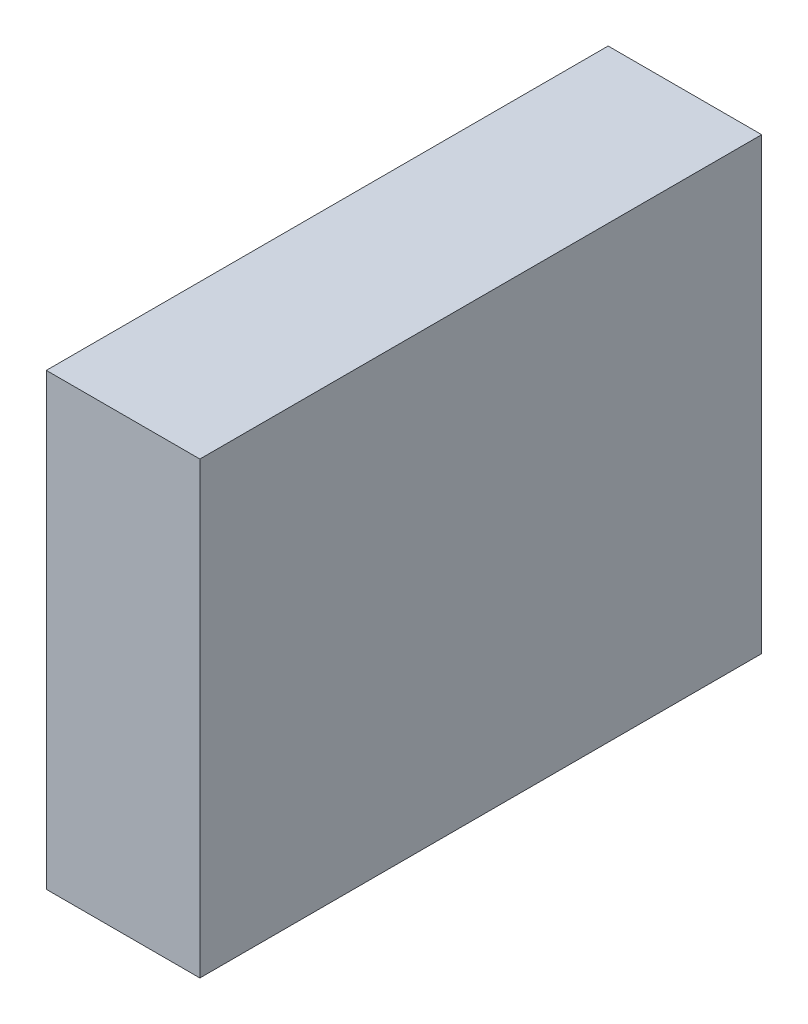
ISO-10303-21;
HEADER;
FILE_DESCRIPTION(('STEP AP214'),'2;1');
FILE_NAME('part.step','',(''),(''),'','','');
FILE_SCHEMA(('AUTOMOTIVE_DESIGN { 1 0 10303 214 1 1 1 1 }'));
ENDSEC;
DATA;
#1=APPLICATION_CONTEXT('core data for automotive mechanical design processes');
#2=APPLICATION_PROTOCOL_DEFINITION('international standard','automotive_design',2000,#1);
#3=PRODUCT_CONTEXT('',#1,'mechanical');
#4=PRODUCT('Part','Part','',(#3));
#5=PRODUCT_RELATED_PRODUCT_CATEGORY('part','',(#4));
#6=PRODUCT_DEFINITION_FORMATION('','',#4);
#7=PRODUCT_DEFINITION_CONTEXT('part definition',#1,'design');
#8=PRODUCT_DEFINITION('design','',#6,#7);
#9=PRODUCT_DEFINITION_SHAPE('','',#8);
#10=(LENGTH_UNIT() NAMED_UNIT(*) SI_UNIT(.MILLI.,.METRE.));
#11=(NAMED_UNIT(*) PLANE_ANGLE_UNIT() SI_UNIT($,.RADIAN.));
#12=(NAMED_UNIT(*) SI_UNIT($,.STERADIAN.) SOLID_ANGLE_UNIT());
#13=UNCERTAINTY_MEASURE_WITH_UNIT(LENGTH_MEASURE(1.E-05),#10,'distance_accuracy_value','');
#14=(GEOMETRIC_REPRESENTATION_CONTEXT(3) GLOBAL_UNCERTAINTY_ASSIGNED_CONTEXT((#13)) GLOBAL_UNIT_ASSIGNED_CONTEXT((#10,
#11,#12)) REPRESENTATION_CONTEXT('',''));
#15=CARTESIAN_POINT('',(0.,0.,0.));
#16=DIRECTION('',(0.,0.,1.));
#17=DIRECTION('',(1.,0.,0.));
#18=AXIS2_PLACEMENT_3D('',#15,#16,#17);
#19=CARTESIAN_POINT('',(4.1,-5.99999999999999,-7.50000000000001));
#20=DIRECTION('',(0.,0.,1.));
#21=DIRECTION('',(1.,0.,0.));
#22=AXIS2_PLACEMENT_3D('',#19,#20,#21);
#23=PLANE('',#22);
#24=DIRECTION('',(0.,1.,0.));
#25=VECTOR('',#24,1.);
#26=CARTESIAN_POINT('',(0.,-5.99999999999999,-7.50000000000001));
#27=LINE('',#26,#25);
#28=CARTESIAN_POINT('',(0.,-5.99999999999999,-7.50000000000001));
#29=VERTEX_POINT('',#28);
#30=CARTESIAN_POINT('',(0.,6.00000000000001,-7.50000000000001));
#31=VERTEX_POINT('',#30);
#32=EDGE_CURVE('E96',#29,#31,#27,.T.);
#33=ORIENTED_EDGE('',*,*,#32,.T.);
#34=DIRECTION('',(-1.,0.,0.));
#35=VECTOR('',#34,1.);
#36=CARTESIAN_POINT('',(4.1,6.00000000000001,-7.50000000000001));
#37=LINE('',#36,#35);
#38=CARTESIAN_POINT('',(4.1,6.00000000000001,-7.50000000000001));
#39=VERTEX_POINT('',#38);
#40=EDGE_CURVE('E11',#39,#31,#37,.T.);
#41=ORIENTED_EDGE('',*,*,#40,.F.);
#42=DIRECTION('',(0.,1.,0.));
#43=VECTOR('',#42,1.);
#44=CARTESIAN_POINT('',(4.1,-5.99999999999999,-7.50000000000001));
#45=LINE('',#44,#43);
#46=CARTESIAN_POINT('',(4.1,-5.99999999999999,-7.50000000000001));
#47=VERTEX_POINT('',#46);
#48=EDGE_CURVE('E84',#47,#39,#45,.T.);
#49=ORIENTED_EDGE('',*,*,#48,.F.);
#50=DIRECTION('',(-1.,0.,0.));
#51=VECTOR('',#50,1.);
#52=CARTESIAN_POINT('',(4.1,-5.99999999999999,-7.50000000000001));
#53=LINE('',#52,#51);
#54=EDGE_CURVE('E92',#47,#29,#53,.T.);
#55=ORIENTED_EDGE('',*,*,#54,.T.);
#56=EDGE_LOOP('',(#33,#41,#49,#55));
#57=FACE_BOUND('',#56,.T.);
#58=ADVANCED_FACE('F33',(#57),#23,.F.);
#59=CARTESIAN_POINT('',(4.1,6.00000000000001,7.49999999999999));
#60=DIRECTION('',(0.,-1.,0.));
#61=DIRECTION('',(0.,0.,-1.));
#62=AXIS2_PLACEMENT_3D('',#59,#60,#61);
#63=PLANE('',#62);
#64=DIRECTION('',(0.,0.,1.));
#65=VECTOR('',#64,1.);
#66=CARTESIAN_POINT('',(0.,6.00000000000001,7.49999999999999));
#67=LINE('',#66,#65);
#68=CARTESIAN_POINT('',(0.,6.00000000000001,7.49999999999999));
#69=VERTEX_POINT('',#68);
#70=EDGE_CURVE('E88',#31,#69,#67,.T.);
#71=ORIENTED_EDGE('',*,*,#70,.T.);
#72=DIRECTION('',(-1.,0.,0.));
#73=VECTOR('',#72,1.);
#74=CARTESIAN_POINT('',(4.1,6.00000000000001,7.49999999999999));
#75=LINE('',#74,#73);
#76=CARTESIAN_POINT('',(4.1,6.00000000000001,7.49999999999999));
#77=VERTEX_POINT('',#76);
#78=EDGE_CURVE('E41',#77,#69,#75,.T.);
#79=ORIENTED_EDGE('',*,*,#78,.F.);
#80=DIRECTION('',(0.,0.,1.));
#81=VECTOR('',#80,1.);
#82=CARTESIAN_POINT('',(4.1,6.00000000000001,7.49999999999999));
#83=LINE('',#82,#81);
#84=EDGE_CURVE('E79',#39,#77,#83,.T.);
#85=ORIENTED_EDGE('',*,*,#84,.F.);
#86=ORIENTED_EDGE('',*,*,#40,.T.);
#87=EDGE_LOOP('',(#71,#79,#85,#86));
#88=FACE_BOUND('',#87,.T.);
#89=ADVANCED_FACE('F87',(#88),#63,.F.);
#90=CARTESIAN_POINT('',(4.1,-5.99999999999999,7.49999999999999));
#91=DIRECTION('',(0.,0.,-1.));
#92=DIRECTION('',(-1.,0.,0.));
#93=AXIS2_PLACEMENT_3D('',#90,#91,#92);
#94=PLANE('',#93);
#95=DIRECTION('',(0.,-1.,0.));
#96=VECTOR('',#95,1.);
#97=CARTESIAN_POINT('',(0.,-5.99999999999999,7.49999999999999));
#98=LINE('',#97,#96);
#99=CARTESIAN_POINT('',(0.,-5.99999999999999,7.49999999999999));
#100=VERTEX_POINT('',#99);
#101=EDGE_CURVE('E66',#69,#100,#98,.T.);
#102=ORIENTED_EDGE('',*,*,#101,.T.);
#103=DIRECTION('',(-1.,0.,0.));
#104=VECTOR('',#103,1.);
#105=CARTESIAN_POINT('',(4.1,-5.99999999999999,7.49999999999999));
#106=LINE('',#105,#104);
#107=CARTESIAN_POINT('',(4.1,-5.99999999999999,7.49999999999999));
#108=VERTEX_POINT('',#107);
#109=EDGE_CURVE('E89',#108,#100,#106,.T.);
#110=ORIENTED_EDGE('',*,*,#109,.F.);
#111=DIRECTION('',(0.,-1.,0.));
#112=VECTOR('',#111,1.);
#113=CARTESIAN_POINT('',(4.1,-5.99999999999999,7.49999999999999));
#114=LINE('',#113,#112);
#115=EDGE_CURVE('E82',#77,#108,#114,.T.);
#116=ORIENTED_EDGE('',*,*,#115,.F.);
#117=ORIENTED_EDGE('',*,*,#78,.T.);
#118=EDGE_LOOP('',(#102,#110,#116,#117));
#119=FACE_BOUND('',#118,.T.);
#120=ADVANCED_FACE('F90',(#119),#94,.F.);
#121=CARTESIAN_POINT('',(4.1,-5.99999999999999,7.49999999999999));
#122=DIRECTION('',(0.,1.,0.));
#123=DIRECTION('',(0.,0.,1.));
#124=AXIS2_PLACEMENT_3D('',#121,#122,#123);
#125=PLANE('',#124);
#126=DIRECTION('',(0.,0.,-1.));
#127=VECTOR('',#126,1.);
#128=CARTESIAN_POINT('',(0.,-5.99999999999999,7.49999999999999));
#129=LINE('',#128,#127);
#130=EDGE_CURVE('E72',#100,#29,#129,.T.);
#131=ORIENTED_EDGE('',*,*,#130,.T.);
#132=ORIENTED_EDGE('',*,*,#54,.F.);
#133=DIRECTION('',(0.,0.,-1.));
#134=VECTOR('',#133,1.);
#135=CARTESIAN_POINT('',(4.1,-5.99999999999999,7.49999999999999));
#136=LINE('',#135,#134);
#137=EDGE_CURVE('E49',#108,#47,#136,.T.);
#138=ORIENTED_EDGE('',*,*,#137,.F.);
#139=ORIENTED_EDGE('',*,*,#109,.T.);
#140=EDGE_LOOP('',(#131,#132,#138,#139));
#141=FACE_BOUND('',#140,.T.);
#142=ADVANCED_FACE('F103',(#141),#125,.F.);
#143=CARTESIAN_POINT('',(4.1,0.,0.));
#144=DIRECTION('',(-1.,0.,0.));
#145=DIRECTION('',(0.,0.,1.));
#146=AXIS2_PLACEMENT_3D('',#143,#144,#145);
#147=PLANE('',#146);
#148=ORIENTED_EDGE('',*,*,#48,.T.);
#149=ORIENTED_EDGE('',*,*,#84,.T.);
#150=ORIENTED_EDGE('',*,*,#115,.T.);
#151=ORIENTED_EDGE('',*,*,#137,.T.);
#152=EDGE_LOOP('',(#148,#149,#150,#151));
#153=FACE_BOUND('',#152,.T.);
#154=ADVANCED_FACE('F80',(#153),#147,.F.);
#155=CARTESIAN_POINT('',(0.,0.,0.));
#156=DIRECTION('',(-1.,0.,0.));
#157=DIRECTION('',(0.,0.,1.));
#158=AXIS2_PLACEMENT_3D('',#155,#156,#157);
#159=PLANE('',#158);
#160=ORIENTED_EDGE('',*,*,#32,.F.);
#161=ORIENTED_EDGE('',*,*,#130,.F.);
#162=ORIENTED_EDGE('',*,*,#101,.F.);
#163=ORIENTED_EDGE('',*,*,#70,.F.);
#164=EDGE_LOOP('',(#160,#161,#162,#163));
#165=FACE_BOUND('',#164,.T.);
#166=ADVANCED_FACE('F106',(#165),#159,.T.);
#167=CLOSED_SHELL('',(#58,#89,#120,#142,#154,#166));
#168=MANIFOLD_SOLID_BREP('B2',#167);
#169=ADVANCED_BREP_SHAPE_REPRESENTATION('',(#18,#168),#14);
#170=SHAPE_DEFINITION_REPRESENTATION(#9,#169);
ENDSEC;
END-ISO-10303-21;
